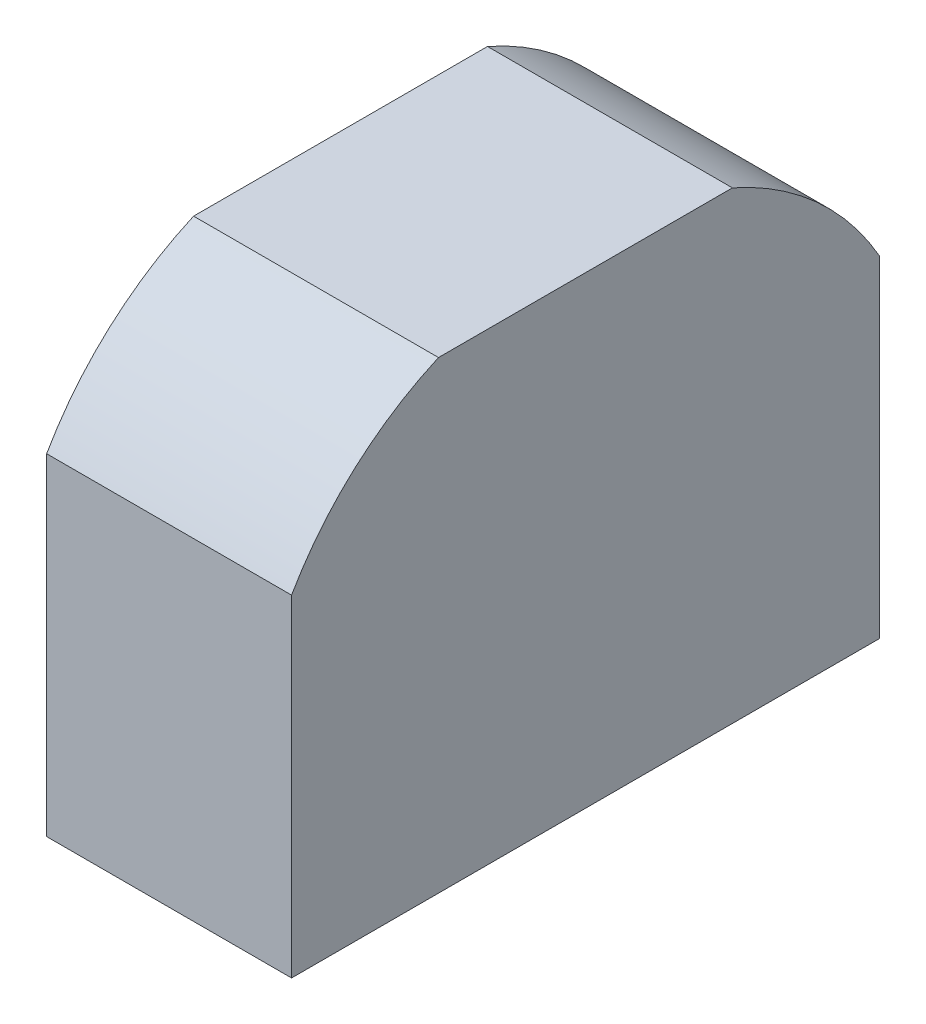
ISO-10303-21;
HEADER;
FILE_DESCRIPTION(('STEP AP214'),'2;1');
FILE_NAME('part.step','',(''),(''),'','','');
FILE_SCHEMA(('AUTOMOTIVE_DESIGN { 1 0 10303 214 1 1 1 1 }'));
ENDSEC;
DATA;
#1=APPLICATION_CONTEXT('core data for automotive mechanical design processes');
#2=APPLICATION_PROTOCOL_DEFINITION('international standard','automotive_design',2000,#1);
#3=PRODUCT_CONTEXT('',#1,'mechanical');
#4=PRODUCT('Part','Part','',(#3));
#5=PRODUCT_RELATED_PRODUCT_CATEGORY('part','',(#4));
#6=PRODUCT_DEFINITION_FORMATION('','',#4);
#7=PRODUCT_DEFINITION_CONTEXT('part definition',#1,'design');
#8=PRODUCT_DEFINITION('design','',#6,#7);
#9=PRODUCT_DEFINITION_SHAPE('','',#8);
#10=(LENGTH_UNIT() NAMED_UNIT(*) SI_UNIT(.MILLI.,.METRE.));
#11=(NAMED_UNIT(*) PLANE_ANGLE_UNIT() SI_UNIT($,.RADIAN.));
#12=(NAMED_UNIT(*) SI_UNIT($,.STERADIAN.) SOLID_ANGLE_UNIT());
#13=UNCERTAINTY_MEASURE_WITH_UNIT(LENGTH_MEASURE(1.E-05),#10,'distance_accuracy_value','');
#14=(GEOMETRIC_REPRESENTATION_CONTEXT(3) GLOBAL_UNCERTAINTY_ASSIGNED_CONTEXT((#13)) GLOBAL_UNIT_ASSIGNED_CONTEXT((#10,
#11,#12)) REPRESENTATION_CONTEXT('',''));
#15=CARTESIAN_POINT('',(0.,0.,0.));
#16=DIRECTION('',(0.,0.,1.));
#17=DIRECTION('',(1.,0.,0.));
#18=AXIS2_PLACEMENT_3D('',#15,#16,#17);
#19=CARTESIAN_POINT('',(-77.5,0.,0.));
#20=DIRECTION('',(1.,0.,0.));
#21=DIRECTION('',(0.,0.,-1.));
#22=AXIS2_PLACEMENT_3D('',#19,#20,#21);
#23=PLANE('',#22);
#24=DIRECTION('',(0.,-1.,0.));
#25=VECTOR('',#24,1.);
#26=CARTESIAN_POINT('',(-77.5,0.,2.66253303792653));
#27=LINE('',#26,#25);
#28=CARTESIAN_POINT('',(-77.5,11.7280363412354,2.66253303792653));
#29=VERTEX_POINT('',#28);
#30=CARTESIAN_POINT('',(-77.5,6.22857263242506,2.66253303792653));
#31=VERTEX_POINT('',#30);
#32=EDGE_CURVE('E782',#29,#31,#27,.T.);
#33=ORIENTED_EDGE('',*,*,#32,.T.);
#34=DIRECTION('',(0.,0.,1.));
#35=VECTOR('',#34,1.);
#36=CARTESIAN_POINT('',(-77.5,6.22857263242506,0.));
#37=LINE('',#36,#35);
#38=CARTESIAN_POINT('',(-77.5,6.22857263242506,-2.66253303792653));
#39=VERTEX_POINT('',#38);
#40=EDGE_CURVE('E773',#39,#31,#37,.T.);
#41=ORIENTED_EDGE('',*,*,#40,.F.);
#42=DIRECTION('',(0.,-1.,0.));
#43=VECTOR('',#42,1.);
#44=CARTESIAN_POINT('',(-77.5,0.,-2.66253303792653));
#45=LINE('',#44,#43);
#46=CARTESIAN_POINT('',(-77.5,11.7280363412354,-2.66253303792653));
#47=VERTEX_POINT('',#46);
#48=EDGE_CURVE('E788',#47,#39,#45,.T.);
#49=ORIENTED_EDGE('',*,*,#48,.F.);
#50=DIRECTION('',(0.,0.,1.));
#51=VECTOR('',#50,1.);
#52=CARTESIAN_POINT('',(-77.5,11.7280363412354,0.));
#53=LINE('',#52,#51);
#54=EDGE_CURVE('E784',#47,#29,#53,.T.);
#55=ORIENTED_EDGE('',*,*,#54,.T.);
#56=EDGE_LOOP('',(#33,#41,#49,#55));
#57=FACE_BOUND('',#56,.T.);
#58=DIRECTION('',(0.,1.,0.));
#59=VECTOR('',#58,1.);
#60=CARTESIAN_POINT('',(-77.5,0.,6.08672742265751));
#61=LINE('',#60,#59);
#62=CARTESIAN_POINT('',(-77.5,20.2366405699609,6.08672742265751));
#63=VERTEX_POINT('',#62);
#64=CARTESIAN_POINT('',(-77.5,27.5000832042387,6.08672742265751));
#65=VERTEX_POINT('',#64);
#66=EDGE_CURVE('E712',#63,#65,#61,.T.);
#67=ORIENTED_EDGE('',*,*,#66,.T.);
#68=DIRECTION('',(0.,0.338198726163152,0.941074716280074));
#69=VECTOR('',#68,1.);
#70=CARTESIAN_POINT('',(-77.5,22.4174439001967,-8.05626890163319));
#71=LINE('',#70,#69);
#72=CARTESIAN_POINT('',(-77.5,32.2732026496212,19.3684510967655));
#73=VERTEX_POINT('',#72);
#74=EDGE_CURVE('E700',#65,#73,#71,.T.);
#75=ORIENTED_EDGE('',*,*,#74,.T.);
#76=DIRECTION('',(0.,-1.,0.));
#77=VECTOR('',#76,1.);
#78=CARTESIAN_POINT('',(-77.5,0.,19.3684510967655));
#79=LINE('',#78,#77);
#80=CARTESIAN_POINT('',(-77.5,20.2366405699609,19.3684510967655));
#81=VERTEX_POINT('',#80);
#82=EDGE_CURVE('E705',#73,#81,#79,.T.);
#83=ORIENTED_EDGE('',*,*,#82,.T.);
#84=DIRECTION('',(0.,0.,-1.));
#85=VECTOR('',#84,1.);
#86=CARTESIAN_POINT('',(-77.5,20.2366405699609,0.));
#87=LINE('',#86,#85);
#88=EDGE_CURVE('E715',#81,#63,#87,.T.);
#89=ORIENTED_EDGE('',*,*,#88,.T.);
#90=EDGE_LOOP('',(#67,#75,#83,#89));
#91=FACE_BOUND('',#90,.T.);
#92=DIRECTION('',(0.,0.338198726163152,-0.941074716280074));
#93=VECTOR('',#92,1.);
#94=CARTESIAN_POINT('',(-77.5,22.4174439001967,8.05626890163319));
#95=LINE('',#94,#93);
#96=CARTESIAN_POINT('',(-77.5,27.5000832042387,-6.0867274226575));
#97=VERTEX_POINT('',#96);
#98=CARTESIAN_POINT('',(-77.5,32.2732026496212,-19.3684510967655));
#99=VERTEX_POINT('',#98);
#100=EDGE_CURVE('E850',#97,#99,#95,.T.);
#101=ORIENTED_EDGE('',*,*,#100,.F.);
#102=DIRECTION('',(0.,1.,0.));
#103=VECTOR('',#102,1.);
#104=CARTESIAN_POINT('',(-77.5,0.,-6.08672742265751));
#105=LINE('',#104,#103);
#106=CARTESIAN_POINT('',(-77.5,20.2366405699609,-6.08672742265751));
#107=VERTEX_POINT('',#106);
#108=EDGE_CURVE('E723',#107,#97,#105,.T.);
#109=ORIENTED_EDGE('',*,*,#108,.F.);
#110=DIRECTION('',(0.,0.,1.));
#111=VECTOR('',#110,1.);
#112=CARTESIAN_POINT('',(-77.5,20.2366405699609,0.));
#113=LINE('',#112,#111);
#114=CARTESIAN_POINT('',(-77.5,20.2366405699609,-19.3684510967655));
#115=VERTEX_POINT('',#114);
#116=EDGE_CURVE('E839',#115,#107,#113,.T.);
#117=ORIENTED_EDGE('',*,*,#116,.F.);
#118=DIRECTION('',(0.,-1.,0.));
#119=VECTOR('',#118,1.);
#120=CARTESIAN_POINT('',(-77.5,0.,-19.3684510967655));
#121=LINE('',#120,#119);
#122=EDGE_CURVE('E853',#99,#115,#121,.T.);
#123=ORIENTED_EDGE('',*,*,#122,.F.);
#124=EDGE_LOOP('',(#101,#109,#117,#123));
#125=FACE_BOUND('',#124,.T.);
#126=CARTESIAN_POINT('',(-77.5,7.29214816101573,8.39546454569578));
#127=DIRECTION('',(-1.,0.,0.));
#128=DIRECTION('',(0.,0.,1.));
#129=AXIS2_PLACEMENT_3D('',#126,#127,#128);
#130=CIRCLE('',#129,4.56161121232725);
#131=CARTESIAN_POINT('',(-77.5,11.7280363412354,9.45904007428649));
#132=VERTEX_POINT('',#131);
#133=CARTESIAN_POINT('',(-77.5,8.35572368960639,12.8313527259155));
#134=VERTEX_POINT('',#133);
#135=EDGE_CURVE('E745',#132,#134,#130,.F.);
#136=ORIENTED_EDGE('',*,*,#135,.T.);
#137=DIRECTION('',(0.,-1.,0.));
#138=VECTOR('',#137,1.);
#139=CARTESIAN_POINT('',(-77.5,0.,12.8313527259155));
#140=LINE('',#139,#138);
#141=CARTESIAN_POINT('',(-77.5,6.22857263242506,12.8313527259155));
#142=VERTEX_POINT('',#141);
#143=EDGE_CURVE('E734',#134,#142,#140,.T.);
#144=ORIENTED_EDGE('',*,*,#143,.T.);
#145=DIRECTION('',(0.,0.,1.));
#146=VECTOR('',#145,1.);
#147=CARTESIAN_POINT('',(-77.5,6.22857263242506,0.));
#148=LINE('',#147,#146);
#149=CARTESIAN_POINT('',(-77.5,6.22857263242506,6.08672742265751));
#150=VERTEX_POINT('',#149);
#151=EDGE_CURVE('E755',#150,#142,#148,.T.);
#152=ORIENTED_EDGE('',*,*,#151,.F.);
#153=DIRECTION('',(0.,-1.,0.));
#154=VECTOR('',#153,1.);
#155=CARTESIAN_POINT('',(-77.5,0.,6.08672742265751));
#156=LINE('',#155,#154);
#157=CARTESIAN_POINT('',(-77.5,11.7280363412354,6.08672742265751));
#158=VERTEX_POINT('',#157);
#159=EDGE_CURVE('E752',#158,#150,#156,.T.);
#160=ORIENTED_EDGE('',*,*,#159,.F.);
#161=DIRECTION('',(0.,0.,1.));
#162=VECTOR('',#161,1.);
#163=CARTESIAN_POINT('',(-77.5,11.7280363412354,0.));
#164=LINE('',#163,#162);
#165=EDGE_CURVE('E748',#158,#132,#164,.T.);
#166=ORIENTED_EDGE('',*,*,#165,.T.);
#167=EDGE_LOOP('',(#136,#144,#152,#160,#166));
#168=FACE_BOUND('',#167,.T.);
#169=CARTESIAN_POINT('',(-77.5,7.29214816101573,-8.39546454569578));
#170=DIRECTION('',(-1.,0.,0.));
#171=DIRECTION('',(0.,0.,1.));
#172=AXIS2_PLACEMENT_3D('',#169,#170,#171);
#173=CIRCLE('',#172,4.56161121232725);
#174=CARTESIAN_POINT('',(-77.5,11.7280363412354,-9.45904007428649));
#175=VERTEX_POINT('',#174);
#176=CARTESIAN_POINT('',(-77.5,8.35572368960639,-12.8313527259155));
#177=VERTEX_POINT('',#176);
#178=EDGE_CURVE('E816',#175,#177,#173,.T.);
#179=ORIENTED_EDGE('',*,*,#178,.F.);
#180=DIRECTION('',(0.,0.,-1.));
#181=VECTOR('',#180,1.);
#182=CARTESIAN_POINT('',(-77.5,11.7280363412354,0.));
#183=LINE('',#182,#181);
#184=CARTESIAN_POINT('',(-77.5,11.7280363412354,-6.08672742265751));
#185=VERTEX_POINT('',#184);
#186=EDGE_CURVE('E67',#185,#175,#183,.T.);
#187=ORIENTED_EDGE('',*,*,#186,.F.);
#188=DIRECTION('',(0.,-1.,0.));
#189=VECTOR('',#188,1.);
#190=CARTESIAN_POINT('',(-77.5,0.,-6.08672742265751));
#191=LINE('',#190,#189);
#192=CARTESIAN_POINT('',(-77.5,6.22857263242506,-6.08672742265751));
#193=VERTEX_POINT('',#192);
#194=EDGE_CURVE('E804',#185,#193,#191,.T.);
#195=ORIENTED_EDGE('',*,*,#194,.T.);
#196=DIRECTION('',(0.,0.,-1.));
#197=VECTOR('',#196,1.);
#198=CARTESIAN_POINT('',(-77.5,6.22857263242506,0.));
#199=LINE('',#198,#197);
#200=CARTESIAN_POINT('',(-77.5,6.22857263242506,-12.8313527259155));
#201=VERTEX_POINT('',#200);
#202=EDGE_CURVE('E822',#193,#201,#199,.T.);
#203=ORIENTED_EDGE('',*,*,#202,.T.);
#204=DIRECTION('',(0.,-1.,0.));
#205=VECTOR('',#204,1.);
#206=CARTESIAN_POINT('',(-77.5,0.,-12.8313527259155));
#207=LINE('',#206,#205);
#208=EDGE_CURVE('E819',#177,#201,#207,.T.);
#209=ORIENTED_EDGE('',*,*,#208,.F.);
#210=EDGE_LOOP('',(#179,#187,#195,#203,#209));
#211=FACE_BOUND('',#210,.T.);
#212=DIRECTION('',(0.,0.,-1.));
#213=VECTOR('',#212,1.);
#214=CARTESIAN_POINT('',(-77.5,47.3493477962848,15.));
#215=LINE('',#214,#213);
#216=CARTESIAN_POINT('',(-77.5,47.3493477962848,15.));
#217=VERTEX_POINT('',#216);
#218=CARTESIAN_POINT('',(-77.5,47.3493477962848,-15.));
#219=VERTEX_POINT('',#218);
#220=EDGE_CURVE('E230',#217,#219,#215,.T.);
#221=ORIENTED_EDGE('',*,*,#220,.T.);
#222=CARTESIAN_POINT('',(-77.5,17.8917235726277,-2.06034032552135));
#223=DIRECTION('',(1.,0.,0.));
#224=DIRECTION('',(0.,0.,-1.));
#225=AXIS2_PLACEMENT_3D('',#222,#223,#224);
#226=CIRCLE('',#225,32.1743130057741);
#227=CARTESIAN_POINT('',(-77.5,33.8467176079708,-30.));
#228=VERTEX_POINT('',#227);
#229=EDGE_CURVE('E239',#228,#219,#226,.T.);
#230=ORIENTED_EDGE('',*,*,#229,.F.);
#231=DIRECTION('',(0.,1.,0.));
#232=VECTOR('',#231,1.);
#233=CARTESIAN_POINT('',(-77.5,0.,-30.));
#234=LINE('',#233,#232);
#235=CARTESIAN_POINT('',(-77.5,0.,-30.));
#236=VERTEX_POINT('',#235);
#237=EDGE_CURVE('E248',#236,#228,#234,.T.);
#238=ORIENTED_EDGE('',*,*,#237,.F.);
#239=DIRECTION('',(0.,0.,1.));
#240=VECTOR('',#239,1.);
#241=CARTESIAN_POINT('',(-77.5,0.,-15.));
#242=LINE('',#241,#240);
#243=CARTESIAN_POINT('',(-77.5,0.,30.));
#244=VERTEX_POINT('',#243);
#245=EDGE_CURVE('E278',#236,#244,#242,.T.);
#246=ORIENTED_EDGE('',*,*,#245,.T.);
#247=DIRECTION('',(0.,1.,0.));
#248=VECTOR('',#247,1.);
#249=CARTESIAN_POINT('',(-77.5,0.,30.));
#250=LINE('',#249,#248);
#251=CARTESIAN_POINT('',(-77.5,33.8467176079708,30.));
#252=VERTEX_POINT('',#251);
#253=EDGE_CURVE('E250',#244,#252,#250,.T.);
#254=ORIENTED_EDGE('',*,*,#253,.T.);
#255=CARTESIAN_POINT('',(-77.5,17.8917235726277,2.06034032552135));
#256=DIRECTION('',(1.,0.,0.));
#257=DIRECTION('',(0.,0.,-1.));
#258=AXIS2_PLACEMENT_3D('',#255,#256,#257);
#259=CIRCLE('',#258,32.1743130057741);
#260=EDGE_CURVE('E242',#252,#217,#259,.F.);
#261=ORIENTED_EDGE('',*,*,#260,.T.);
#262=EDGE_LOOP('',(#221,#230,#238,#246,#254,#261));
#263=FACE_BOUND('',#262,.T.);
#264=ADVANCED_FACE('F45',(#57,#91,#125,#168,#211,#263),#23,.F.);
#265=CARTESIAN_POINT('',(-52.5,17.8917235726277,-2.06034032552135));
#266=DIRECTION('',(-1.,0.,0.));
#267=DIRECTION('',(0.,0.,1.));
#268=AXIS2_PLACEMENT_3D('',#265,#266,#267);
#269=CYLINDRICAL_SURFACE('',#268,32.1743130057741);
#270=ORIENTED_EDGE('',*,*,#229,.T.);
#271=DIRECTION('',(-1.,0.,0.));
#272=VECTOR('',#271,1.);
#273=CARTESIAN_POINT('',(-52.5,47.3493477962849,-15.));
#274=LINE('',#273,#272);
#275=CARTESIAN_POINT('',(-52.5,47.3493477962848,-15.));
#276=VERTEX_POINT('',#275);
#277=EDGE_CURVE('E11',#219,#276,#274,.F.);
#278=ORIENTED_EDGE('',*,*,#277,.T.);
#279=CARTESIAN_POINT('',(-52.5,17.8917235726277,-2.06034032552135));
#280=DIRECTION('',(1.,0.,0.));
#281=DIRECTION('',(0.,0.,-1.));
#282=AXIS2_PLACEMENT_3D('',#279,#280,#281);
#283=CIRCLE('',#282,32.1743130057741);
#284=CARTESIAN_POINT('',(-52.5,33.8467176079708,-30.));
#285=VERTEX_POINT('',#284);
#286=EDGE_CURVE('E867',#285,#276,#283,.T.);
#287=ORIENTED_EDGE('',*,*,#286,.F.);
#288=DIRECTION('',(-1.,0.,0.));
#289=VECTOR('',#288,1.);
#290=CARTESIAN_POINT('',(-52.5,33.8467176079708,-30.));
#291=LINE('',#290,#289);
#292=EDGE_CURVE('E246',#285,#228,#291,.T.);
#293=ORIENTED_EDGE('',*,*,#292,.T.);
#294=EDGE_LOOP('',(#270,#278,#287,#293));
#295=FACE_BOUND('',#294,.T.);
#296=ADVANCED_FACE('F244',(#295),#269,.T.);
#297=CARTESIAN_POINT('',(-52.5,17.8917235726277,2.06034032552135));
#298=DIRECTION('',(-1.,0.,0.));
#299=DIRECTION('',(0.,0.,1.));
#300=AXIS2_PLACEMENT_3D('',#297,#298,#299);
#301=CYLINDRICAL_SURFACE('',#300,32.1743130057741);
#302=DIRECTION('',(-1.,0.,0.));
#303=VECTOR('',#302,1.);
#304=CARTESIAN_POINT('',(-52.5,47.3493477962849,15.));
#305=LINE('',#304,#303);
#306=CARTESIAN_POINT('',(-52.5,47.3493477962848,15.));
#307=VERTEX_POINT('',#306);
#308=EDGE_CURVE('E53',#307,#217,#305,.T.);
#309=ORIENTED_EDGE('',*,*,#308,.T.);
#310=ORIENTED_EDGE('',*,*,#260,.F.);
#311=DIRECTION('',(-1.,0.,0.));
#312=VECTOR('',#311,1.);
#313=CARTESIAN_POINT('',(-52.5,33.8467176079708,30.));
#314=LINE('',#313,#312);
#315=CARTESIAN_POINT('',(-52.5,33.8467176079708,30.));
#316=VERTEX_POINT('',#315);
#317=EDGE_CURVE('E265',#316,#252,#314,.T.);
#318=ORIENTED_EDGE('',*,*,#317,.F.);
#319=CARTESIAN_POINT('',(-52.5,17.8917235726277,2.06034032552135));
#320=DIRECTION('',(1.,0.,0.));
#321=DIRECTION('',(0.,0.,-1.));
#322=AXIS2_PLACEMENT_3D('',#319,#320,#321);
#323=CIRCLE('',#322,32.1743130057741);
#324=EDGE_CURVE('E869',#316,#307,#323,.F.);
#325=ORIENTED_EDGE('',*,*,#324,.T.);
#326=EDGE_LOOP('',(#309,#310,#318,#325));
#327=FACE_BOUND('',#326,.T.);
#328=ADVANCED_FACE('F292',(#327),#301,.T.);
#329=CARTESIAN_POINT('',(-52.5,0.,0.));
#330=DIRECTION('',(1.,0.,0.));
#331=DIRECTION('',(0.,0.,-1.));
#332=AXIS2_PLACEMENT_3D('',#329,#330,#331);
#333=PLANE('',#332);
#334=ORIENTED_EDGE('',*,*,#286,.T.);
#335=DIRECTION('',(0.,0.,1.));
#336=VECTOR('',#335,1.);
#337=CARTESIAN_POINT('',(-52.5,47.3493477962849,-30.));
#338=LINE('',#337,#336);
#339=EDGE_CURVE('E233',#276,#307,#338,.T.);
#340=ORIENTED_EDGE('',*,*,#339,.T.);
#341=ORIENTED_EDGE('',*,*,#324,.F.);
#342=DIRECTION('',(0.,1.,0.));
#343=VECTOR('',#342,1.);
#344=CARTESIAN_POINT('',(-52.5,0.,30.));
#345=LINE('',#344,#343);
#346=CARTESIAN_POINT('',(-52.5,0.,30.));
#347=VERTEX_POINT('',#346);
#348=EDGE_CURVE('E290',#347,#316,#345,.T.);
#349=ORIENTED_EDGE('',*,*,#348,.F.);
#350=DIRECTION('',(0.,0.,-1.));
#351=VECTOR('',#350,1.);
#352=CARTESIAN_POINT('',(-52.5,0.,0.));
#353=LINE('',#352,#351);
#354=CARTESIAN_POINT('',(-52.5,0.,-30.));
#355=VERTEX_POINT('',#354);
#356=EDGE_CURVE('E262',#347,#355,#353,.T.);
#357=ORIENTED_EDGE('',*,*,#356,.T.);
#358=DIRECTION('',(0.,1.,0.));
#359=VECTOR('',#358,1.);
#360=CARTESIAN_POINT('',(-52.5,0.,-30.));
#361=LINE('',#360,#359);
#362=EDGE_CURVE('E257',#355,#285,#361,.T.);
#363=ORIENTED_EDGE('',*,*,#362,.T.);
#364=EDGE_LOOP('',(#334,#340,#341,#349,#357,#363));
#365=FACE_BOUND('',#364,.T.);
#366=ADVANCED_FACE('F294',(#365),#333,.T.);
#367=CARTESIAN_POINT('',(-52.5,0.,-30.));
#368=DIRECTION('',(0.,0.,1.));
#369=DIRECTION('',(1.,0.,0.));
#370=AXIS2_PLACEMENT_3D('',#367,#368,#369);
#371=PLANE('',#370);
#372=ORIENTED_EDGE('',*,*,#237,.T.);
#373=ORIENTED_EDGE('',*,*,#292,.F.);
#374=ORIENTED_EDGE('',*,*,#362,.F.);
#375=DIRECTION('',(-1.,0.,0.));
#376=VECTOR('',#375,1.);
#377=CARTESIAN_POINT('',(-52.5,0.,-30.));
#378=LINE('',#377,#376);
#379=EDGE_CURVE('E258',#355,#236,#378,.T.);
#380=ORIENTED_EDGE('',*,*,#379,.T.);
#381=EDGE_LOOP('',(#372,#373,#374,#380));
#382=FACE_BOUND('',#381,.T.);
#383=ADVANCED_FACE('F300',(#382),#371,.F.);
#384=CARTESIAN_POINT('',(-52.5,0.,30.));
#385=DIRECTION('',(0.,0.,1.));
#386=DIRECTION('',(1.,0.,0.));
#387=AXIS2_PLACEMENT_3D('',#384,#385,#386);
#388=PLANE('',#387);
#389=ORIENTED_EDGE('',*,*,#253,.F.);
#390=DIRECTION('',(-1.,0.,0.));
#391=VECTOR('',#390,1.);
#392=CARTESIAN_POINT('',(-52.5,0.,30.));
#393=LINE('',#392,#391);
#394=EDGE_CURVE('E261',#347,#244,#393,.T.);
#395=ORIENTED_EDGE('',*,*,#394,.F.);
#396=ORIENTED_EDGE('',*,*,#348,.T.);
#397=ORIENTED_EDGE('',*,*,#317,.T.);
#398=EDGE_LOOP('',(#389,#395,#396,#397));
#399=FACE_BOUND('',#398,.T.);
#400=ADVANCED_FACE('F289',(#399),#388,.T.);
#401=CARTESIAN_POINT('',(-67.5000000000002,-5.,-10.));
#402=DIRECTION('',(0.,1.,0.));
#403=DIRECTION('',(0.,0.,1.));
#404=AXIS2_PLACEMENT_3D('',#401,#402,#403);
#405=PLANE('',#404);
#406=CARTESIAN_POINT('',(-67.5000000000002,-5.,-10.));
#407=DIRECTION('',(0.,-1.,0.));
#408=DIRECTION('',(0.,0.,1.));
#409=AXIS2_PLACEMENT_3D('',#406,#407,#408);
#410=CIRCLE('',#409,2.45);
#411=CARTESIAN_POINT('',(-67.5000000000002,-5.,-7.55));
#412=VERTEX_POINT('',#411);
#413=EDGE_CURVE('E272',#412,#412,#410,.T.);
#414=ORIENTED_EDGE('',*,*,#413,.T.);
#415=EDGE_LOOP('',(#414));
#416=FACE_BOUND('',#415,.T.);
#417=ADVANCED_FACE('F315',(#416),#405,.F.);
#418=CARTESIAN_POINT('',(-67.5,-5.,10.));
#419=DIRECTION('',(0.,1.,0.));
#420=DIRECTION('',(0.,0.,1.));
#421=AXIS2_PLACEMENT_3D('',#418,#419,#420);
#422=PLANE('',#421);
#423=CARTESIAN_POINT('',(-67.5,-5.,10.));
#424=DIRECTION('',(0.,-1.,0.));
#425=DIRECTION('',(0.,0.,1.));
#426=AXIS2_PLACEMENT_3D('',#423,#424,#425);
#427=CIRCLE('',#426,2.45);
#428=CARTESIAN_POINT('',(-67.5,-5.,12.45));
#429=VERTEX_POINT('',#428);
#430=EDGE_CURVE('E268',#429,#429,#427,.T.);
#431=ORIENTED_EDGE('',*,*,#430,.T.);
#432=EDGE_LOOP('',(#431));
#433=FACE_BOUND('',#432,.T.);
#434=ADVANCED_FACE('F321',(#433),#422,.F.);
#435=CARTESIAN_POINT('',(-67.5000000000002,-5.,-10.));
#436=DIRECTION('',(0.,1.,0.));
#437=DIRECTION('',(0.,0.,1.));
#438=AXIS2_PLACEMENT_3D('',#435,#436,#437);
#439=CYLINDRICAL_SURFACE('',#438,2.45);
#440=ORIENTED_EDGE('',*,*,#413,.F.);
#441=EDGE_LOOP('',(#440));
#442=FACE_BOUND('',#441,.T.);
#443=CARTESIAN_POINT('',(-67.5000000000002,0.,-10.));
#444=DIRECTION('',(0.,-1.,0.));
#445=DIRECTION('',(0.,0.,1.));
#446=AXIS2_PLACEMENT_3D('',#443,#444,#445);
#447=CIRCLE('',#446,2.45);
#448=CARTESIAN_POINT('',(-67.5000000000002,0.,-7.55));
#449=VERTEX_POINT('',#448);
#450=EDGE_CURVE('E275',#449,#449,#447,.T.);
#451=ORIENTED_EDGE('',*,*,#450,.T.);
#452=EDGE_LOOP('',(#451));
#453=FACE_BOUND('',#452,.T.);
#454=ADVANCED_FACE('F332',(#442,#453),#439,.T.);
#455=CARTESIAN_POINT('',(-67.5,-5.,10.));
#456=DIRECTION('',(0.,1.,0.));
#457=DIRECTION('',(0.,0.,1.));
#458=AXIS2_PLACEMENT_3D('',#455,#456,#457);
#459=CYLINDRICAL_SURFACE('',#458,2.45);
#460=ORIENTED_EDGE('',*,*,#430,.F.);
#461=EDGE_LOOP('',(#460));
#462=FACE_BOUND('',#461,.T.);
#463=CARTESIAN_POINT('',(-67.5,0.,10.));
#464=DIRECTION('',(0.,-1.,0.));
#465=DIRECTION('',(0.,0.,1.));
#466=AXIS2_PLACEMENT_3D('',#463,#464,#465);
#467=CIRCLE('',#466,2.45);
#468=CARTESIAN_POINT('',(-67.5,0.,12.45));
#469=VERTEX_POINT('',#468);
#470=EDGE_CURVE('E269',#469,#469,#467,.T.);
#471=ORIENTED_EDGE('',*,*,#470,.T.);
#472=EDGE_LOOP('',(#471));
#473=FACE_BOUND('',#472,.T.);
#474=ADVANCED_FACE('F329',(#462,#473),#459,.T.);
#475=CARTESIAN_POINT('',(-77.5,0.,-15.));
#476=DIRECTION('',(0.,-1.,0.));
#477=DIRECTION('',(0.,0.,-1.));
#478=AXIS2_PLACEMENT_3D('',#475,#476,#477);
#479=PLANE('',#478);
#480=ORIENTED_EDGE('',*,*,#245,.F.);
#481=ORIENTED_EDGE('',*,*,#379,.F.);
#482=ORIENTED_EDGE('',*,*,#356,.F.);
#483=ORIENTED_EDGE('',*,*,#394,.T.);
#484=EDGE_LOOP('',(#480,#481,#482,#483));
#485=FACE_BOUND('',#484,.T.);
#486=ORIENTED_EDGE('',*,*,#470,.F.);
#487=EDGE_LOOP('',(#486));
#488=FACE_BOUND('',#487,.T.);
#489=ORIENTED_EDGE('',*,*,#450,.F.);
#490=EDGE_LOOP('',(#489));
#491=FACE_BOUND('',#490,.T.);
#492=ADVANCED_FACE('F47',(#485,#488,#491),#479,.T.);
#493=CARTESIAN_POINT('',(-74.5,0.,-6.08672742265751));
#494=DIRECTION('',(0.,0.,1.));
#495=DIRECTION('',(1.,0.,0.));
#496=AXIS2_PLACEMENT_3D('',#493,#494,#495);
#497=PLANE('',#496);
#498=ORIENTED_EDGE('',*,*,#108,.T.);
#499=DIRECTION('',(-1.,0.,0.));
#500=VECTOR('',#499,1.);
#501=CARTESIAN_POINT('',(-74.5,27.5000832042387,-6.08672742265751));
#502=LINE('',#501,#500);
#503=CARTESIAN_POINT('',(-74.5,27.5000832042387,-6.08672742265751));
#504=VERTEX_POINT('',#503);
#505=EDGE_CURVE('E848',#504,#97,#502,.T.);
#506=ORIENTED_EDGE('',*,*,#505,.F.);
#507=DIRECTION('',(0.,1.,0.));
#508=VECTOR('',#507,1.);
#509=CARTESIAN_POINT('',(-74.5,0.,-6.08672742265751));
#510=LINE('',#509,#508);
#511=CARTESIAN_POINT('',(-74.5,20.2366405699609,-6.08672742265751));
#512=VERTEX_POINT('',#511);
#513=EDGE_CURVE('E835',#512,#504,#510,.T.);
#514=ORIENTED_EDGE('',*,*,#513,.F.);
#515=DIRECTION('',(-1.,0.,0.));
#516=VECTOR('',#515,1.);
#517=CARTESIAN_POINT('',(-74.5,20.2366405699609,-6.08672742265751));
#518=LINE('',#517,#516);
#519=EDGE_CURVE('E252',#512,#107,#518,.T.);
#520=ORIENTED_EDGE('',*,*,#519,.T.);
#521=EDGE_LOOP('',(#498,#506,#514,#520));
#522=FACE_BOUND('',#521,.T.);
#523=ADVANCED_FACE('F344',(#522),#497,.F.);
#524=CARTESIAN_POINT('',(-74.5,20.2366405699609,0.));
#525=DIRECTION('',(0.,-1.,0.));
#526=DIRECTION('',(0.,0.,-1.));
#527=AXIS2_PLACEMENT_3D('',#524,#525,#526);
#528=PLANE('',#527);
#529=ORIENTED_EDGE('',*,*,#116,.T.);
#530=ORIENTED_EDGE('',*,*,#519,.F.);
#531=DIRECTION('',(0.,0.,1.));
#532=VECTOR('',#531,1.);
#533=CARTESIAN_POINT('',(-74.5,20.2366405699609,0.));
#534=LINE('',#533,#532);
#535=CARTESIAN_POINT('',(-74.5,20.2366405699609,-19.3684510967655));
#536=VERTEX_POINT('',#535);
#537=EDGE_CURVE('E845',#536,#512,#534,.T.);
#538=ORIENTED_EDGE('',*,*,#537,.F.);
#539=DIRECTION('',(-1.,0.,0.));
#540=VECTOR('',#539,1.);
#541=CARTESIAN_POINT('',(-74.5,20.2366405699609,-19.3684510967655));
#542=LINE('',#541,#540);
#543=EDGE_CURVE('E859',#536,#115,#542,.T.);
#544=ORIENTED_EDGE('',*,*,#543,.T.);
#545=EDGE_LOOP('',(#529,#530,#538,#544));
#546=FACE_BOUND('',#545,.T.);
#547=ADVANCED_FACE('F348',(#546),#528,.F.);
#548=CARTESIAN_POINT('',(-74.5,0.,-19.3684510967655));
#549=DIRECTION('',(0.,0.,-1.));
#550=DIRECTION('',(-1.,0.,0.));
#551=AXIS2_PLACEMENT_3D('',#548,#549,#550);
#552=PLANE('',#551);
#553=ORIENTED_EDGE('',*,*,#122,.T.);
#554=ORIENTED_EDGE('',*,*,#543,.F.);
#555=DIRECTION('',(0.,-1.,0.));
#556=VECTOR('',#555,1.);
#557=CARTESIAN_POINT('',(-74.5,0.,-19.3684510967655));
#558=LINE('',#557,#556);
#559=CARTESIAN_POINT('',(-74.5,32.2732026496212,-19.3684510967655));
#560=VERTEX_POINT('',#559);
#561=EDGE_CURVE('E842',#560,#536,#558,.T.);
#562=ORIENTED_EDGE('',*,*,#561,.F.);
#563=DIRECTION('',(-1.,0.,0.));
#564=VECTOR('',#563,1.);
#565=CARTESIAN_POINT('',(-74.5,32.2732026496212,-19.3684510967655));
#566=LINE('',#565,#564);
#567=EDGE_CURVE('E861',#560,#99,#566,.T.);
#568=ORIENTED_EDGE('',*,*,#567,.T.);
#569=EDGE_LOOP('',(#553,#554,#562,#568));
#570=FACE_BOUND('',#569,.T.);
#571=ADVANCED_FACE('F353',(#570),#552,.F.);
#572=CARTESIAN_POINT('',(-74.5,22.4174439001967,8.05626890163319));
#573=DIRECTION('',(0.,0.941074716280074,0.338198726163151));
#574=DIRECTION('',(0.,-0.338198726163152,0.941074716280074));
#575=AXIS2_PLACEMENT_3D('',#572,#573,#574);
#576=PLANE('',#575);
#577=ORIENTED_EDGE('',*,*,#100,.T.);
#578=ORIENTED_EDGE('',*,*,#567,.F.);
#579=DIRECTION('',(0.,0.338198726163152,-0.941074716280074));
#580=VECTOR('',#579,1.);
#581=CARTESIAN_POINT('',(-74.5,22.4174439001967,8.05626890163319));
#582=LINE('',#581,#580);
#583=EDGE_CURVE('E838',#504,#560,#582,.T.);
#584=ORIENTED_EDGE('',*,*,#583,.F.);
#585=ORIENTED_EDGE('',*,*,#505,.T.);
#586=EDGE_LOOP('',(#577,#578,#584,#585));
#587=FACE_BOUND('',#586,.T.);
#588=ADVANCED_FACE('F357',(#587),#576,.F.);
#589=CARTESIAN_POINT('',(-74.5,0.,0.));
#590=DIRECTION('',(-1.,0.,0.));
#591=DIRECTION('',(0.,0.,1.));
#592=AXIS2_PLACEMENT_3D('',#589,#590,#591);
#593=PLANE('',#592);
#594=ORIENTED_EDGE('',*,*,#513,.T.);
#595=ORIENTED_EDGE('',*,*,#583,.T.);
#596=ORIENTED_EDGE('',*,*,#561,.T.);
#597=ORIENTED_EDGE('',*,*,#537,.T.);
#598=EDGE_LOOP('',(#594,#595,#596,#597));
#599=FACE_BOUND('',#598,.T.);
#600=ADVANCED_FACE('F360',(#599),#593,.T.);
#601=CARTESIAN_POINT('',(-74.5,0.,6.08672742265751));
#602=DIRECTION('',(0.,0.,1.));
#603=DIRECTION('',(1.,0.,0.));
#604=AXIS2_PLACEMENT_3D('',#601,#602,#603);
#605=PLANE('',#604);
#606=ORIENTED_EDGE('',*,*,#66,.F.);
#607=DIRECTION('',(-1.,0.,0.));
#608=VECTOR('',#607,1.);
#609=CARTESIAN_POINT('',(-74.5,20.2366405699609,6.08672742265751));
#610=LINE('',#609,#608);
#611=CARTESIAN_POINT('',(-74.5,20.2366405699609,6.08672742265751));
#612=VERTEX_POINT('',#611);
#613=EDGE_CURVE('E711',#612,#63,#610,.T.);
#614=ORIENTED_EDGE('',*,*,#613,.F.);
#615=DIRECTION('',(0.,1.,0.));
#616=VECTOR('',#615,1.);
#617=CARTESIAN_POINT('',(-74.5,0.,6.08672742265751));
#618=LINE('',#617,#616);
#619=CARTESIAN_POINT('',(-74.5,27.5000832042387,6.08672742265751));
#620=VERTEX_POINT('',#619);
#621=EDGE_CURVE('E693',#612,#620,#618,.T.);
#622=ORIENTED_EDGE('',*,*,#621,.T.);
#623=DIRECTION('',(-1.,0.,0.));
#624=VECTOR('',#623,1.);
#625=CARTESIAN_POINT('',(-74.5,27.5000832042387,6.08672742265751));
#626=LINE('',#625,#624);
#627=EDGE_CURVE('E721',#620,#65,#626,.T.);
#628=ORIENTED_EDGE('',*,*,#627,.T.);
#629=EDGE_LOOP('',(#606,#614,#622,#628));
#630=FACE_BOUND('',#629,.T.);
#631=ADVANCED_FACE('F367',(#630),#605,.T.);
#632=CARTESIAN_POINT('',(-74.5,22.4174439001967,-8.05626890163319));
#633=DIRECTION('',(0.,-0.941074716280074,0.338198726163151));
#634=DIRECTION('',(0.,-0.338198726163152,-0.941074716280074));
#635=AXIS2_PLACEMENT_3D('',#632,#633,#634);
#636=PLANE('',#635);
#637=ORIENTED_EDGE('',*,*,#74,.F.);
#638=ORIENTED_EDGE('',*,*,#627,.F.);
#639=DIRECTION('',(0.,0.338198726163152,0.941074716280074));
#640=VECTOR('',#639,1.);
#641=CARTESIAN_POINT('',(-74.5,22.4174439001967,-8.05626890163319));
#642=LINE('',#641,#640);
#643=CARTESIAN_POINT('',(-74.5,32.2732026496212,19.3684510967655));
#644=VERTEX_POINT('',#643);
#645=EDGE_CURVE('E696',#620,#644,#642,.T.);
#646=ORIENTED_EDGE('',*,*,#645,.T.);
#647=DIRECTION('',(-1.,0.,0.));
#648=VECTOR('',#647,1.);
#649=CARTESIAN_POINT('',(-74.5,32.2732026496212,19.3684510967655));
#650=LINE('',#649,#648);
#651=EDGE_CURVE('E724',#644,#73,#650,.T.);
#652=ORIENTED_EDGE('',*,*,#651,.T.);
#653=EDGE_LOOP('',(#637,#638,#646,#652));
#654=FACE_BOUND('',#653,.T.);
#655=ADVANCED_FACE('F438',(#654),#636,.T.);
#656=CARTESIAN_POINT('',(-74.5,0.,19.3684510967655));
#657=DIRECTION('',(0.,0.,-1.));
#658=DIRECTION('',(-1.,0.,0.));
#659=AXIS2_PLACEMENT_3D('',#656,#657,#658);
#660=PLANE('',#659);
#661=ORIENTED_EDGE('',*,*,#82,.F.);
#662=ORIENTED_EDGE('',*,*,#651,.F.);
#663=DIRECTION('',(0.,-1.,0.));
#664=VECTOR('',#663,1.);
#665=CARTESIAN_POINT('',(-74.5,0.,19.3684510967655));
#666=LINE('',#665,#664);
#667=CARTESIAN_POINT('',(-74.5,20.2366405699609,19.3684510967655));
#668=VERTEX_POINT('',#667);
#669=EDGE_CURVE('E702',#644,#668,#666,.T.);
#670=ORIENTED_EDGE('',*,*,#669,.T.);
#671=DIRECTION('',(-1.,0.,0.));
#672=VECTOR('',#671,1.);
#673=CARTESIAN_POINT('',(-74.5,20.2366405699609,19.3684510967655));
#674=LINE('',#673,#672);
#675=EDGE_CURVE('E726',#668,#81,#674,.T.);
#676=ORIENTED_EDGE('',*,*,#675,.T.);
#677=EDGE_LOOP('',(#661,#662,#670,#676));
#678=FACE_BOUND('',#677,.T.);
#679=ADVANCED_FACE('F443',(#678),#660,.T.);
#680=CARTESIAN_POINT('',(-74.5,20.2366405699609,0.));
#681=DIRECTION('',(0.,1.,0.));
#682=DIRECTION('',(0.,0.,1.));
#683=AXIS2_PLACEMENT_3D('',#680,#681,#682);
#684=PLANE('',#683);
#685=ORIENTED_EDGE('',*,*,#88,.F.);
#686=ORIENTED_EDGE('',*,*,#675,.F.);
#687=DIRECTION('',(0.,0.,-1.));
#688=VECTOR('',#687,1.);
#689=CARTESIAN_POINT('',(-74.5,20.2366405699609,0.));
#690=LINE('',#689,#688);
#691=EDGE_CURVE('E695',#668,#612,#690,.T.);
#692=ORIENTED_EDGE('',*,*,#691,.T.);
#693=ORIENTED_EDGE('',*,*,#613,.T.);
#694=EDGE_LOOP('',(#685,#686,#692,#693));
#695=FACE_BOUND('',#694,.T.);
#696=ADVANCED_FACE('F440',(#695),#684,.T.);
#697=CARTESIAN_POINT('',(-74.5,0.,0.));
#698=DIRECTION('',(-1.,0.,0.));
#699=DIRECTION('',(0.,0.,1.));
#700=AXIS2_PLACEMENT_3D('',#697,#698,#699);
#701=PLANE('',#700);
#702=ORIENTED_EDGE('',*,*,#621,.F.);
#703=ORIENTED_EDGE('',*,*,#691,.F.);
#704=ORIENTED_EDGE('',*,*,#669,.F.);
#705=ORIENTED_EDGE('',*,*,#645,.F.);
#706=EDGE_LOOP('',(#702,#703,#704,#705));
#707=FACE_BOUND('',#706,.T.);
#708=ADVANCED_FACE('F416',(#707),#701,.T.);
#709=CARTESIAN_POINT('',(-74.5,7.29214816101573,8.39546454569578));
#710=DIRECTION('',(-1.,0.,0.));
#711=DIRECTION('',(0.,0.,1.));
#712=AXIS2_PLACEMENT_3D('',#709,#710,#711);
#713=CYLINDRICAL_SURFACE('',#712,4.56161121232725);
#714=ORIENTED_EDGE('',*,*,#135,.F.);
#715=DIRECTION('',(-1.,0.,0.));
#716=VECTOR('',#715,1.);
#717=CARTESIAN_POINT('',(-74.5,11.7280363412354,9.45904007428649));
#718=LINE('',#717,#716);
#719=CARTESIAN_POINT('',(-74.5,11.7280363412354,9.45904007428649));
#720=VERTEX_POINT('',#719);
#721=EDGE_CURVE('E744',#720,#132,#718,.T.);
#722=ORIENTED_EDGE('',*,*,#721,.F.);
#723=CARTESIAN_POINT('',(-74.5,7.29214816101573,8.39546454569578));
#724=DIRECTION('',(-1.,0.,0.));
#725=DIRECTION('',(0.,0.,1.));
#726=AXIS2_PLACEMENT_3D('',#723,#724,#725);
#727=CIRCLE('',#726,4.56161121232725);
#728=CARTESIAN_POINT('',(-74.5,8.35572368960639,12.8313527259155));
#729=VERTEX_POINT('',#728);
#730=EDGE_CURVE('E730',#720,#729,#727,.F.);
#731=ORIENTED_EDGE('',*,*,#730,.T.);
#732=DIRECTION('',(-1.,0.,0.));
#733=VECTOR('',#732,1.);
#734=CARTESIAN_POINT('',(-74.5,8.35572368960639,12.8313527259155));
#735=LINE('',#734,#733);
#736=EDGE_CURVE('E716',#729,#134,#735,.T.);
#737=ORIENTED_EDGE('',*,*,#736,.T.);
#738=EDGE_LOOP('',(#714,#722,#731,#737));
#739=FACE_BOUND('',#738,.T.);
#740=ADVANCED_FACE('F412',(#739),#713,.F.);
#741=CARTESIAN_POINT('',(-74.5,0.,12.8313527259155));
#742=DIRECTION('',(0.,0.,-1.));
#743=DIRECTION('',(-1.,0.,0.));
#744=AXIS2_PLACEMENT_3D('',#741,#742,#743);
#745=PLANE('',#744);
#746=ORIENTED_EDGE('',*,*,#143,.F.);
#747=ORIENTED_EDGE('',*,*,#736,.F.);
#748=DIRECTION('',(0.,-1.,0.));
#749=VECTOR('',#748,1.);
#750=CARTESIAN_POINT('',(-74.5,0.,12.8313527259155));
#751=LINE('',#750,#749);
#752=CARTESIAN_POINT('',(-74.5,6.22857263242506,12.8313527259155));
#753=VERTEX_POINT('',#752);
#754=EDGE_CURVE('E742',#729,#753,#751,.T.);
#755=ORIENTED_EDGE('',*,*,#754,.T.);
#756=DIRECTION('',(-1.,0.,0.));
#757=VECTOR('',#756,1.);
#758=CARTESIAN_POINT('',(-74.5,6.22857263242506,12.8313527259155));
#759=LINE('',#758,#757);
#760=EDGE_CURVE('E762',#753,#142,#759,.T.);
#761=ORIENTED_EDGE('',*,*,#760,.T.);
#762=EDGE_LOOP('',(#746,#747,#755,#761));
#763=FACE_BOUND('',#762,.T.);
#764=ADVANCED_FACE('F415',(#763),#745,.T.);
#765=CARTESIAN_POINT('',(-74.5,6.22857263242506,0.));
#766=DIRECTION('',(0.,-1.,0.));
#767=DIRECTION('',(0.,0.,-1.));
#768=AXIS2_PLACEMENT_3D('',#765,#766,#767);
#769=PLANE('',#768);
#770=ORIENTED_EDGE('',*,*,#151,.T.);
#771=ORIENTED_EDGE('',*,*,#760,.F.);
#772=DIRECTION('',(0.,0.,1.));
#773=VECTOR('',#772,1.);
#774=CARTESIAN_POINT('',(-74.5,6.22857263242506,0.));
#775=LINE('',#774,#773);
#776=CARTESIAN_POINT('',(-74.5,6.22857263242506,6.08672742265751));
#777=VERTEX_POINT('',#776);
#778=EDGE_CURVE('E739',#777,#753,#775,.T.);
#779=ORIENTED_EDGE('',*,*,#778,.F.);
#780=DIRECTION('',(-1.,0.,0.));
#781=VECTOR('',#780,1.);
#782=CARTESIAN_POINT('',(-74.5,6.22857263242506,6.08672742265751));
#783=LINE('',#782,#781);
#784=EDGE_CURVE('E764',#777,#150,#783,.T.);
#785=ORIENTED_EDGE('',*,*,#784,.T.);
#786=EDGE_LOOP('',(#770,#771,#779,#785));
#787=FACE_BOUND('',#786,.T.);
#788=ADVANCED_FACE('F425',(#787),#769,.F.);
#789=CARTESIAN_POINT('',(-74.5,0.,6.08672742265751));
#790=DIRECTION('',(0.,0.,-1.));
#791=DIRECTION('',(-1.,0.,0.));
#792=AXIS2_PLACEMENT_3D('',#789,#790,#791);
#793=PLANE('',#792);
#794=ORIENTED_EDGE('',*,*,#159,.T.);
#795=ORIENTED_EDGE('',*,*,#784,.F.);
#796=DIRECTION('',(0.,-1.,0.));
#797=VECTOR('',#796,1.);
#798=CARTESIAN_POINT('',(-74.5,0.,6.08672742265751));
#799=LINE('',#798,#797);
#800=CARTESIAN_POINT('',(-74.5,11.7280363412354,6.08672742265751));
#801=VERTEX_POINT('',#800);
#802=EDGE_CURVE('E736',#801,#777,#799,.T.);
#803=ORIENTED_EDGE('',*,*,#802,.F.);
#804=DIRECTION('',(-1.,0.,0.));
#805=VECTOR('',#804,1.);
#806=CARTESIAN_POINT('',(-74.5,11.7280363412354,6.08672742265751));
#807=LINE('',#806,#805);
#808=EDGE_CURVE('E766',#801,#158,#807,.T.);
#809=ORIENTED_EDGE('',*,*,#808,.T.);
#810=EDGE_LOOP('',(#794,#795,#803,#809));
#811=FACE_BOUND('',#810,.T.);
#812=ADVANCED_FACE('F421',(#811),#793,.F.);
#813=CARTESIAN_POINT('',(-74.5,11.7280363412354,0.));
#814=DIRECTION('',(0.,-1.,0.));
#815=DIRECTION('',(0.,0.,-1.));
#816=AXIS2_PLACEMENT_3D('',#813,#814,#815);
#817=PLANE('',#816);
#818=ORIENTED_EDGE('',*,*,#165,.F.);
#819=ORIENTED_EDGE('',*,*,#808,.F.);
#820=DIRECTION('',(0.,0.,1.));
#821=VECTOR('',#820,1.);
#822=CARTESIAN_POINT('',(-74.5,11.7280363412354,0.));
#823=LINE('',#822,#821);
#824=EDGE_CURVE('E733',#801,#720,#823,.T.);
#825=ORIENTED_EDGE('',*,*,#824,.T.);
#826=ORIENTED_EDGE('',*,*,#721,.T.);
#827=EDGE_LOOP('',(#818,#819,#825,#826));
#828=FACE_BOUND('',#827,.T.);
#829=ADVANCED_FACE('F418',(#828),#817,.T.);
#830=CARTESIAN_POINT('',(-74.5,0.,0.));
#831=DIRECTION('',(-1.,0.,0.));
#832=DIRECTION('',(0.,0.,1.));
#833=AXIS2_PLACEMENT_3D('',#830,#831,#832);
#834=PLANE('',#833);
#835=ORIENTED_EDGE('',*,*,#730,.F.);
#836=ORIENTED_EDGE('',*,*,#824,.F.);
#837=ORIENTED_EDGE('',*,*,#802,.T.);
#838=ORIENTED_EDGE('',*,*,#778,.T.);
#839=ORIENTED_EDGE('',*,*,#754,.F.);
#840=EDGE_LOOP('',(#835,#836,#837,#838,#839));
#841=FACE_BOUND('',#840,.T.);
#842=ADVANCED_FACE('F396',(#841),#834,.T.);
#843=CARTESIAN_POINT('',(-74.5,0.,2.66253303792653));
#844=DIRECTION('',(0.,0.,-1.));
#845=DIRECTION('',(-1.,0.,0.));
#846=AXIS2_PLACEMENT_3D('',#843,#844,#845);
#847=PLANE('',#846);
#848=ORIENTED_EDGE('',*,*,#32,.F.);
#849=DIRECTION('',(-1.,0.,0.));
#850=VECTOR('',#849,1.);
#851=CARTESIAN_POINT('',(-74.5,11.7280363412354,2.66253303792653));
#852=LINE('',#851,#850);
#853=CARTESIAN_POINT('',(-74.5,11.7280363412354,2.66253303792653));
#854=VERTEX_POINT('',#853);
#855=EDGE_CURVE('E781',#854,#29,#852,.T.);
#856=ORIENTED_EDGE('',*,*,#855,.F.);
#857=DIRECTION('',(0.,-1.,0.));
#858=VECTOR('',#857,1.);
#859=CARTESIAN_POINT('',(-74.5,0.,2.66253303792653));
#860=LINE('',#859,#858);
#861=CARTESIAN_POINT('',(-74.5,6.22857263242506,2.66253303792653));
#862=VERTEX_POINT('',#861);
#863=EDGE_CURVE('E770',#854,#862,#860,.T.);
#864=ORIENTED_EDGE('',*,*,#863,.T.);
#865=DIRECTION('',(-1.,0.,0.));
#866=VECTOR('',#865,1.);
#867=CARTESIAN_POINT('',(-74.5,6.22857263242506,2.66253303792653));
#868=LINE('',#867,#866);
#869=EDGE_CURVE('E749',#862,#31,#868,.T.);
#870=ORIENTED_EDGE('',*,*,#869,.T.);
#871=EDGE_LOOP('',(#848,#856,#864,#870));
#872=FACE_BOUND('',#871,.T.);
#873=ADVANCED_FACE('F392',(#872),#847,.T.);
#874=CARTESIAN_POINT('',(-74.5,6.22857263242506,0.));
#875=DIRECTION('',(0.,-1.,0.));
#876=DIRECTION('',(0.,0.,-1.));
#877=AXIS2_PLACEMENT_3D('',#874,#875,#876);
#878=PLANE('',#877);
#879=ORIENTED_EDGE('',*,*,#40,.T.);
#880=ORIENTED_EDGE('',*,*,#869,.F.);
#881=DIRECTION('',(0.,0.,1.));
#882=VECTOR('',#881,1.);
#883=CARTESIAN_POINT('',(-74.5,6.22857263242506,0.));
#884=LINE('',#883,#882);
#885=CARTESIAN_POINT('',(-74.5,6.22857263242506,-2.66253303792653));
#886=VERTEX_POINT('',#885);
#887=EDGE_CURVE('E778',#886,#862,#884,.T.);
#888=ORIENTED_EDGE('',*,*,#887,.F.);
#889=DIRECTION('',(-1.,0.,0.));
#890=VECTOR('',#889,1.);
#891=CARTESIAN_POINT('',(-74.5,6.22857263242506,-2.66253303792653));
#892=LINE('',#891,#890);
#893=EDGE_CURVE('E794',#886,#39,#892,.T.);
#894=ORIENTED_EDGE('',*,*,#893,.T.);
#895=EDGE_LOOP('',(#879,#880,#888,#894));
#896=FACE_BOUND('',#895,.T.);
#897=ADVANCED_FACE('F395',(#896),#878,.F.);
#898=CARTESIAN_POINT('',(-74.5,0.,-2.66253303792653));
#899=DIRECTION('',(0.,0.,-1.));
#900=DIRECTION('',(-1.,0.,0.));
#901=AXIS2_PLACEMENT_3D('',#898,#899,#900);
#902=PLANE('',#901);
#903=ORIENTED_EDGE('',*,*,#48,.T.);
#904=ORIENTED_EDGE('',*,*,#893,.F.);
#905=DIRECTION('',(0.,-1.,0.));
#906=VECTOR('',#905,1.);
#907=CARTESIAN_POINT('',(-74.5,0.,-2.66253303792653));
#908=LINE('',#907,#906);
#909=CARTESIAN_POINT('',(-74.5,11.7280363412354,-2.66253303792653));
#910=VERTEX_POINT('',#909);
#911=EDGE_CURVE('E775',#910,#886,#908,.T.);
#912=ORIENTED_EDGE('',*,*,#911,.F.);
#913=DIRECTION('',(-1.,0.,0.));
#914=VECTOR('',#913,1.);
#915=CARTESIAN_POINT('',(-74.5,11.7280363412354,-2.66253303792653));
#916=LINE('',#915,#914);
#917=EDGE_CURVE('E796',#910,#47,#916,.T.);
#918=ORIENTED_EDGE('',*,*,#917,.T.);
#919=EDGE_LOOP('',(#903,#904,#912,#918));
#920=FACE_BOUND('',#919,.T.);
#921=ADVANCED_FACE('F401',(#920),#902,.F.);
#922=CARTESIAN_POINT('',(-74.5,11.7280363412354,0.));
#923=DIRECTION('',(0.,-1.,0.));
#924=DIRECTION('',(0.,0.,-1.));
#925=AXIS2_PLACEMENT_3D('',#922,#923,#924);
#926=PLANE('',#925);
#927=ORIENTED_EDGE('',*,*,#54,.F.);
#928=ORIENTED_EDGE('',*,*,#917,.F.);
#929=DIRECTION('',(0.,0.,1.));
#930=VECTOR('',#929,1.);
#931=CARTESIAN_POINT('',(-74.5,11.7280363412354,0.));
#932=LINE('',#931,#930);
#933=EDGE_CURVE('E772',#910,#854,#932,.T.);
#934=ORIENTED_EDGE('',*,*,#933,.T.);
#935=ORIENTED_EDGE('',*,*,#855,.T.);
#936=EDGE_LOOP('',(#927,#928,#934,#935));
#937=FACE_BOUND('',#936,.T.);
#938=ADVANCED_FACE('F398',(#937),#926,.T.);
#939=CARTESIAN_POINT('',(-74.5,0.,0.));
#940=DIRECTION('',(-1.,0.,0.));
#941=DIRECTION('',(0.,0.,1.));
#942=AXIS2_PLACEMENT_3D('',#939,#940,#941);
#943=PLANE('',#942);
#944=ORIENTED_EDGE('',*,*,#863,.F.);
#945=ORIENTED_EDGE('',*,*,#933,.F.);
#946=ORIENTED_EDGE('',*,*,#911,.T.);
#947=ORIENTED_EDGE('',*,*,#887,.T.);
#948=EDGE_LOOP('',(#944,#945,#946,#947));
#949=FACE_BOUND('',#948,.T.);
#950=ADVANCED_FACE('F373',(#949),#943,.T.);
#951=CARTESIAN_POINT('',(-74.5,11.7280363412354,0.));
#952=DIRECTION('',(0.,1.,0.));
#953=DIRECTION('',(0.,0.,1.));
#954=AXIS2_PLACEMENT_3D('',#951,#952,#953);
#955=PLANE('',#954);
#956=ORIENTED_EDGE('',*,*,#186,.T.);
#957=DIRECTION('',(-1.,0.,0.));
#958=VECTOR('',#957,1.);
#959=CARTESIAN_POINT('',(-74.5,11.7280363412354,-9.45904007428649));
#960=LINE('',#959,#958);
#961=CARTESIAN_POINT('',(-74.5,11.7280363412354,-9.45904007428649));
#962=VERTEX_POINT('',#961);
#963=EDGE_CURVE('E814',#962,#175,#960,.T.);
#964=ORIENTED_EDGE('',*,*,#963,.F.);
#965=DIRECTION('',(0.,0.,-1.));
#966=VECTOR('',#965,1.);
#967=CARTESIAN_POINT('',(-74.5,11.7280363412354,0.));
#968=LINE('',#967,#966);
#969=CARTESIAN_POINT('',(-74.5,11.7280363412354,-6.08672742265751));
#970=VERTEX_POINT('',#969);
#971=EDGE_CURVE('E800',#970,#962,#968,.T.);
#972=ORIENTED_EDGE('',*,*,#971,.F.);
#973=DIRECTION('',(-1.,0.,0.));
#974=VECTOR('',#973,1.);
#975=CARTESIAN_POINT('',(-74.5,11.7280363412354,-6.08672742265751));
#976=LINE('',#975,#974);
#977=EDGE_CURVE('E785',#970,#185,#976,.T.);
#978=ORIENTED_EDGE('',*,*,#977,.T.);
#979=EDGE_LOOP('',(#956,#964,#972,#978));
#980=FACE_BOUND('',#979,.T.);
#981=ADVANCED_FACE('F369',(#980),#955,.F.);
#982=CARTESIAN_POINT('',(-74.5,0.,-6.08672742265751));
#983=DIRECTION('',(0.,0.,-1.));
#984=DIRECTION('',(-1.,0.,0.));
#985=AXIS2_PLACEMENT_3D('',#982,#983,#984);
#986=PLANE('',#985);
#987=ORIENTED_EDGE('',*,*,#194,.F.);
#988=ORIENTED_EDGE('',*,*,#977,.F.);
#989=DIRECTION('',(0.,-1.,0.));
#990=VECTOR('',#989,1.);
#991=CARTESIAN_POINT('',(-74.5,0.,-6.08672742265751));
#992=LINE('',#991,#990);
#993=CARTESIAN_POINT('',(-74.5,6.22857263242506,-6.08672742265751));
#994=VERTEX_POINT('',#993);
#995=EDGE_CURVE('E812',#970,#994,#992,.T.);
#996=ORIENTED_EDGE('',*,*,#995,.T.);
#997=DIRECTION('',(-1.,0.,0.));
#998=VECTOR('',#997,1.);
#999=CARTESIAN_POINT('',(-74.5,6.22857263242506,-6.08672742265751));
#1000=LINE('',#999,#998);
#1001=EDGE_CURVE('E828',#994,#193,#1000,.T.);
#1002=ORIENTED_EDGE('',*,*,#1001,.T.);
#1003=EDGE_LOOP('',(#987,#988,#996,#1002));
#1004=FACE_BOUND('',#1003,.T.);
#1005=ADVANCED_FACE('F372',(#1004),#986,.T.);
#1006=CARTESIAN_POINT('',(-74.5,6.22857263242506,0.));
#1007=DIRECTION('',(0.,1.,0.));
#1008=DIRECTION('',(0.,0.,1.));
#1009=AXIS2_PLACEMENT_3D('',#1006,#1007,#1008);
#1010=PLANE('',#1009);
#1011=ORIENTED_EDGE('',*,*,#202,.F.);
#1012=ORIENTED_EDGE('',*,*,#1001,.F.);
#1013=DIRECTION('',(0.,0.,-1.));
#1014=VECTOR('',#1013,1.);
#1015=CARTESIAN_POINT('',(-74.5,6.22857263242506,0.));
#1016=LINE('',#1015,#1014);
#1017=CARTESIAN_POINT('',(-74.5,6.22857263242506,-12.8313527259155));
#1018=VERTEX_POINT('',#1017);
#1019=EDGE_CURVE('E810',#994,#1018,#1016,.T.);
#1020=ORIENTED_EDGE('',*,*,#1019,.T.);
#1021=DIRECTION('',(-1.,0.,0.));
#1022=VECTOR('',#1021,1.);
#1023=CARTESIAN_POINT('',(-74.5,6.22857263242506,-12.8313527259155));
#1024=LINE('',#1023,#1022);
#1025=EDGE_CURVE('E830',#1018,#201,#1024,.T.);
#1026=ORIENTED_EDGE('',*,*,#1025,.T.);
#1027=EDGE_LOOP('',(#1011,#1012,#1020,#1026));
#1028=FACE_BOUND('',#1027,.T.);
#1029=ADVANCED_FACE('F382',(#1028),#1010,.T.);
#1030=CARTESIAN_POINT('',(-74.5,0.,-12.8313527259155));
#1031=DIRECTION('',(0.,0.,-1.));
#1032=DIRECTION('',(-1.,0.,0.));
#1033=AXIS2_PLACEMENT_3D('',#1030,#1031,#1032);
#1034=PLANE('',#1033);
#1035=ORIENTED_EDGE('',*,*,#208,.T.);
#1036=ORIENTED_EDGE('',*,*,#1025,.F.);
#1037=DIRECTION('',(0.,-1.,0.));
#1038=VECTOR('',#1037,1.);
#1039=CARTESIAN_POINT('',(-74.5,0.,-12.8313527259155));
#1040=LINE('',#1039,#1038);
#1041=CARTESIAN_POINT('',(-74.5,8.35572368960639,-12.8313527259155));
#1042=VERTEX_POINT('',#1041);
#1043=EDGE_CURVE('E807',#1042,#1018,#1040,.T.);
#1044=ORIENTED_EDGE('',*,*,#1043,.F.);
#1045=DIRECTION('',(-1.,0.,0.));
#1046=VECTOR('',#1045,1.);
#1047=CARTESIAN_POINT('',(-74.5,8.35572368960639,-12.8313527259155));
#1048=LINE('',#1047,#1046);
#1049=EDGE_CURVE('E832',#1042,#177,#1048,.T.);
#1050=ORIENTED_EDGE('',*,*,#1049,.T.);
#1051=EDGE_LOOP('',(#1035,#1036,#1044,#1050));
#1052=FACE_BOUND('',#1051,.T.);
#1053=ADVANCED_FACE('F378',(#1052),#1034,.F.);
#1054=CARTESIAN_POINT('',(-74.5,7.29214816101573,-8.39546454569578));
#1055=DIRECTION('',(-1.,0.,0.));
#1056=DIRECTION('',(0.,0.,1.));
#1057=AXIS2_PLACEMENT_3D('',#1054,#1055,#1056);
#1058=CYLINDRICAL_SURFACE('',#1057,4.56161121232725);
#1059=ORIENTED_EDGE('',*,*,#178,.T.);
#1060=ORIENTED_EDGE('',*,*,#1049,.F.);
#1061=CARTESIAN_POINT('',(-74.5,7.29214816101573,-8.39546454569578));
#1062=DIRECTION('',(-1.,0.,0.));
#1063=DIRECTION('',(0.,0.,1.));
#1064=AXIS2_PLACEMENT_3D('',#1061,#1062,#1063);
#1065=CIRCLE('',#1064,4.56161121232725);
#1066=EDGE_CURVE('E803',#962,#1042,#1065,.T.);
#1067=ORIENTED_EDGE('',*,*,#1066,.F.);
#1068=ORIENTED_EDGE('',*,*,#963,.T.);
#1069=EDGE_LOOP('',(#1059,#1060,#1067,#1068));
#1070=FACE_BOUND('',#1069,.T.);
#1071=ADVANCED_FACE('F374',(#1070),#1058,.F.);
#1072=CARTESIAN_POINT('',(-74.5,0.,0.));
#1073=DIRECTION('',(-1.,0.,0.));
#1074=DIRECTION('',(0.,0.,1.));
#1075=AXIS2_PLACEMENT_3D('',#1072,#1073,#1074);
#1076=PLANE('',#1075);
#1077=ORIENTED_EDGE('',*,*,#971,.T.);
#1078=ORIENTED_EDGE('',*,*,#1066,.T.);
#1079=ORIENTED_EDGE('',*,*,#1043,.T.);
#1080=ORIENTED_EDGE('',*,*,#1019,.F.);
#1081=ORIENTED_EDGE('',*,*,#995,.F.);
#1082=EDGE_LOOP('',(#1077,#1078,#1079,#1080,#1081));
#1083=FACE_BOUND('',#1082,.T.);
#1084=ADVANCED_FACE('F377',(#1083),#1076,.T.);
#1085=CARTESIAN_POINT('',(61.3538039836688,47.3493477962848,15.));
#1086=DIRECTION('',(0.,1.,0.));
#1087=DIRECTION('',(0.,0.,1.));
#1088=AXIS2_PLACEMENT_3D('',#1085,#1086,#1087);
#1089=PLANE('',#1088);
#1090=ORIENTED_EDGE('',*,*,#277,.F.);
#1091=ORIENTED_EDGE('',*,*,#220,.F.);
#1092=ORIENTED_EDGE('',*,*,#308,.F.);
#1093=ORIENTED_EDGE('',*,*,#339,.F.);
#1094=EDGE_LOOP('',(#1090,#1091,#1092,#1093));
#1095=FACE_BOUND('',#1094,.T.);
#1096=ADVANCED_FACE('F229',(#1095),#1089,.T.);
#1097=CLOSED_SHELL('',(#264,#296,#328,#366,#383,#400,#417,#434,#454,#474,#492,#523,#547,#571,
#588,#600,#631,#655,#679,#696,#708,#740,#764,#788,#812,#829,#842,#873,#897,#921,#938,#950,#981,
#1005,#1029,#1053,#1071,#1084,#1096));
#1098=MANIFOLD_SOLID_BREP('B2',#1097);
#1099=ADVANCED_BREP_SHAPE_REPRESENTATION('',(#18,#1098),#14);
#1100=SHAPE_DEFINITION_REPRESENTATION(#9,#1099);
ENDSEC;
END-ISO-10303-21;
